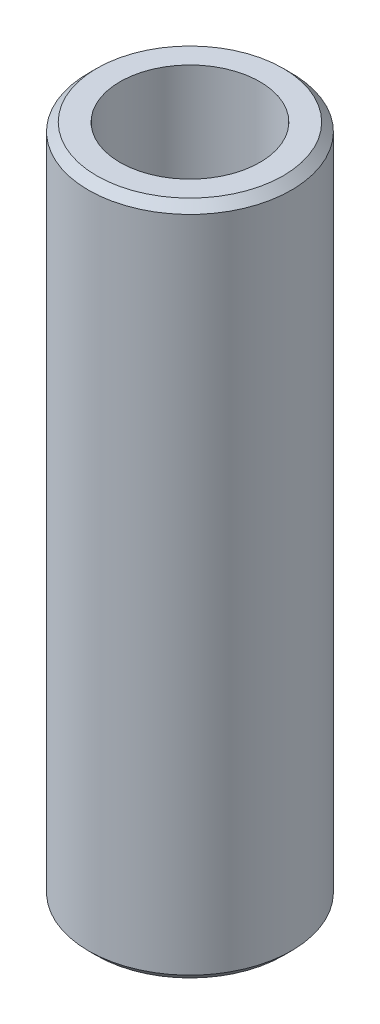
ISO-10303-21;
HEADER;
FILE_DESCRIPTION(('STEP AP214'),'2;1');
FILE_NAME('part.step','',(''),(''),'','','');
FILE_SCHEMA(('AUTOMOTIVE_DESIGN { 1 0 10303 214 1 1 1 1 }'));
ENDSEC;
DATA;
#1=APPLICATION_CONTEXT('core data for automotive mechanical design processes');
#2=APPLICATION_PROTOCOL_DEFINITION('international standard','automotive_design',2000,#1);
#3=PRODUCT_CONTEXT('',#1,'mechanical');
#4=PRODUCT('Part','Part','',(#3));
#5=PRODUCT_RELATED_PRODUCT_CATEGORY('part','',(#4));
#6=PRODUCT_DEFINITION_FORMATION('','',#4);
#7=PRODUCT_DEFINITION_CONTEXT('part definition',#1,'design');
#8=PRODUCT_DEFINITION('design','',#6,#7);
#9=PRODUCT_DEFINITION_SHAPE('','',#8);
#10=(LENGTH_UNIT() NAMED_UNIT(*) SI_UNIT(.MILLI.,.METRE.));
#11=(NAMED_UNIT(*) PLANE_ANGLE_UNIT() SI_UNIT($,.RADIAN.));
#12=(NAMED_UNIT(*) SI_UNIT($,.STERADIAN.) SOLID_ANGLE_UNIT());
#13=UNCERTAINTY_MEASURE_WITH_UNIT(LENGTH_MEASURE(1.E-05),#10,'distance_accuracy_value','');
#14=(GEOMETRIC_REPRESENTATION_CONTEXT(3) GLOBAL_UNCERTAINTY_ASSIGNED_CONTEXT((#13)) GLOBAL_UNIT_ASSIGNED_CONTEXT((#10,
#11,#12)) REPRESENTATION_CONTEXT('',''));
#15=CARTESIAN_POINT('',(0.,0.,0.));
#16=DIRECTION('',(0.,0.,1.));
#17=DIRECTION('',(1.,0.,0.));
#18=AXIS2_PLACEMENT_3D('',#15,#16,#17);
#19=CARTESIAN_POINT('',(0.,83.2252265212086,0.));
#20=DIRECTION('',(0.,-1.,0.));
#21=DIRECTION('',(0.,0.,-1.));
#22=AXIS2_PLACEMENT_3D('',#19,#20,#21);
#23=CYLINDRICAL_SURFACE('',#22,12.5);
#24=CARTESIAN_POINT('',(0.,82.2044748822002,0.));
#25=DIRECTION('',(0.,1.,0.));
#26=DIRECTION('',(0.,0.,1.));
#27=AXIS2_PLACEMENT_3D('',#24,#25,#26);
#28=CIRCLE('',#27,12.5);
#29=CARTESIAN_POINT('',(0.,82.2044748822002,12.5));
#30=VERTEX_POINT('',#29);
#31=EDGE_CURVE('E50',#30,#30,#28,.F.);
#32=ORIENTED_EDGE('',*,*,#31,.T.);
#33=EDGE_LOOP('',(#32));
#34=FACE_BOUND('',#33,.T.);
#35=CARTESIAN_POINT('',(0.,1.02075163900836,0.));
#36=DIRECTION('',(0.,1.,0.));
#37=DIRECTION('',(0.,0.,1.));
#38=AXIS2_PLACEMENT_3D('',#35,#36,#37);
#39=CIRCLE('',#38,12.5);
#40=CARTESIAN_POINT('',(0.,1.02075163900836,12.5));
#41=VERTEX_POINT('',#40);
#42=EDGE_CURVE('E51',#41,#41,#39,.T.);
#43=ORIENTED_EDGE('',*,*,#42,.T.);
#44=EDGE_LOOP('',(#43));
#45=FACE_BOUND('',#44,.T.);
#46=ADVANCED_FACE('F39',(#34,#45),#23,.T.);
#47=CARTESIAN_POINT('',(0.,83.2252265212086,0.));
#48=DIRECTION('',(0.,1.,0.));
#49=DIRECTION('',(0.,0.,1.));
#50=AXIS2_PLACEMENT_3D('',#47,#48,#49);
#51=PLANE('',#50);
#52=CARTESIAN_POINT('',(0.,83.2252265212086,0.));
#53=DIRECTION('',(0.,1.,0.));
#54=DIRECTION('',(0.,0.,1.));
#55=AXIS2_PLACEMENT_3D('',#52,#53,#54);
#56=CIRCLE('',#55,11.4792483609916);
#57=CARTESIAN_POINT('',(0.,83.2252265212086,11.4792483609916));
#58=VERTEX_POINT('',#57);
#59=EDGE_CURVE('E54',#58,#58,#56,.T.);
#60=ORIENTED_EDGE('',*,*,#59,.T.);
#61=EDGE_LOOP('',(#60));
#62=FACE_BOUND('',#61,.T.);
#63=CARTESIAN_POINT('',(0.,83.2252265212086,0.));
#64=DIRECTION('',(0.,1.,0.));
#65=DIRECTION('',(0.,0.,1.));
#66=AXIS2_PLACEMENT_3D('',#63,#64,#65);
#67=CIRCLE('',#66,8.62068054906675);
#68=CARTESIAN_POINT('',(0.,83.2252265212086,8.62068054906675));
#69=VERTEX_POINT('',#68);
#70=EDGE_CURVE('E58',#69,#69,#67,.T.);
#71=ORIENTED_EDGE('',*,*,#70,.F.);
#72=EDGE_LOOP('',(#71));
#73=FACE_BOUND('',#72,.T.);
#74=ADVANCED_FACE('F69',(#62,#73),#51,.T.);
#75=CARTESIAN_POINT('',(0.,0.,0.));
#76=DIRECTION('',(0.,1.,0.));
#77=DIRECTION('',(0.,0.,1.));
#78=AXIS2_PLACEMENT_3D('',#75,#76,#77);
#79=PLANE('',#78);
#80=CARTESIAN_POINT('',(0.,0.,0.));
#81=DIRECTION('',(0.,1.,0.));
#82=DIRECTION('',(0.,0.,1.));
#83=AXIS2_PLACEMENT_3D('',#80,#81,#82);
#84=CIRCLE('',#83,11.4792483609916);
#85=CARTESIAN_POINT('',(0.,0.,11.4792483609916));
#86=VERTEX_POINT('',#85);
#87=EDGE_CURVE('E10',#86,#86,#84,.F.);
#88=ORIENTED_EDGE('',*,*,#87,.T.);
#89=EDGE_LOOP('',(#88));
#90=FACE_BOUND('',#89,.T.);
#91=CARTESIAN_POINT('',(0.,0.,0.));
#92=DIRECTION('',(0.,1.,0.));
#93=DIRECTION('',(0.,0.,1.));
#94=AXIS2_PLACEMENT_3D('',#91,#92,#93);
#95=CIRCLE('',#94,8.62068054906675);
#96=CARTESIAN_POINT('',(0.,0.,8.62068054906675));
#97=VERTEX_POINT('',#96);
#98=EDGE_CURVE('E63',#97,#97,#95,.T.);
#99=ORIENTED_EDGE('',*,*,#98,.T.);
#100=EDGE_LOOP('',(#99));
#101=FACE_BOUND('',#100,.T.);
#102=ADVANCED_FACE('F75',(#90,#101),#79,.F.);
#103=CARTESIAN_POINT('',(0.,83.2252265212086,0.));
#104=DIRECTION('',(0.,-1.,0.));
#105=DIRECTION('',(0.,0.,-1.));
#106=AXIS2_PLACEMENT_3D('',#103,#104,#105);
#107=CYLINDRICAL_SURFACE('',#106,8.62068054906675);
#108=ORIENTED_EDGE('',*,*,#70,.T.);
#109=EDGE_LOOP('',(#108));
#110=FACE_BOUND('',#109,.T.);
#111=ORIENTED_EDGE('',*,*,#98,.F.);
#112=EDGE_LOOP('',(#111));
#113=FACE_BOUND('',#112,.T.);
#114=ADVANCED_FACE('F70',(#110,#113),#107,.F.);
#115=CARTESIAN_POINT('',(0.,83.2252265212086,0.));
#116=DIRECTION('',(0.,-1.,0.));
#117=DIRECTION('',(0.,0.,-1.));
#118=AXIS2_PLACEMENT_3D('',#115,#116,#117);
#119=CONICAL_SURFACE('',#118,11.4792483609916,0.785398163397444);
#120=ORIENTED_EDGE('',*,*,#31,.F.);
#121=EDGE_LOOP('',(#120));
#122=FACE_BOUND('',#121,.T.);
#123=ORIENTED_EDGE('',*,*,#59,.F.);
#124=EDGE_LOOP('',(#123));
#125=FACE_BOUND('',#124,.T.);
#126=ADVANCED_FACE('F81',(#122,#125),#119,.T.);
#127=CARTESIAN_POINT('',(0.,1.02075163900836,0.));
#128=DIRECTION('',(0.,1.,0.));
#129=DIRECTION('',(0.,0.,1.));
#130=AXIS2_PLACEMENT_3D('',#127,#128,#129);
#131=CONICAL_SURFACE('',#130,12.5,0.785398163397452);
#132=ORIENTED_EDGE('',*,*,#87,.F.);
#133=EDGE_LOOP('',(#132));
#134=FACE_BOUND('',#133,.T.);
#135=ORIENTED_EDGE('',*,*,#42,.F.);
#136=EDGE_LOOP('',(#135));
#137=FACE_BOUND('',#136,.T.);
#138=ADVANCED_FACE('F45',(#134,#137),#131,.T.);
#139=CLOSED_SHELL('',(#46,#74,#102,#114,#126,#138));
#140=MANIFOLD_SOLID_BREP('B2',#139);
#141=ADVANCED_BREP_SHAPE_REPRESENTATION('',(#18,#140),#14);
#142=SHAPE_DEFINITION_REPRESENTATION(#9,#141);
ENDSEC;
END-ISO-10303-21;
